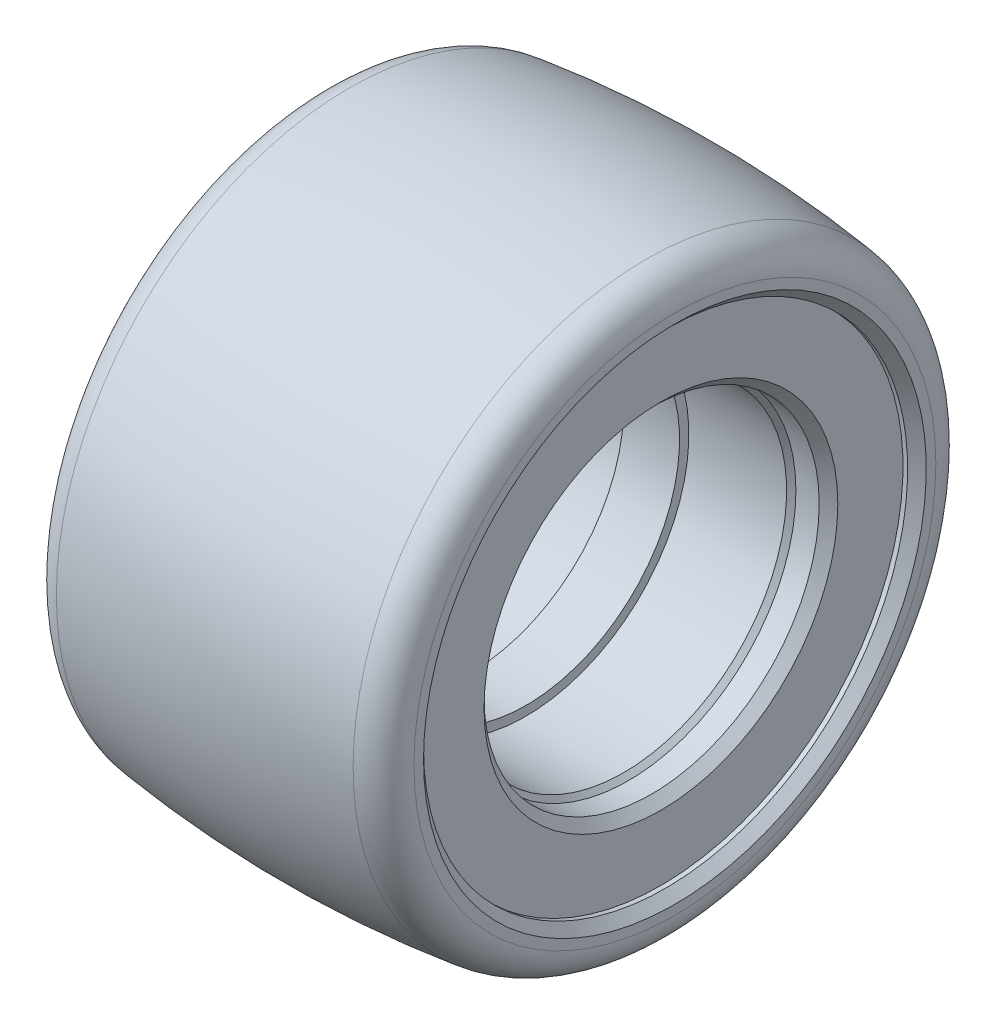
ISO-10303-21;
HEADER;
FILE_DESCRIPTION(('STEP AP214'),'2;1');
FILE_NAME('part.step','',(''),(''),'','','');
FILE_SCHEMA(('AUTOMOTIVE_DESIGN { 1 0 10303 214 1 1 1 1 }'));
ENDSEC;
DATA;
#1=APPLICATION_CONTEXT('core data for automotive mechanical design processes');
#2=APPLICATION_PROTOCOL_DEFINITION('international standard','automotive_design',2000,#1);
#3=PRODUCT_CONTEXT('',#1,'mechanical');
#4=PRODUCT('Part','Part','',(#3));
#5=PRODUCT_RELATED_PRODUCT_CATEGORY('part','',(#4));
#6=PRODUCT_DEFINITION_FORMATION('','',#4);
#7=PRODUCT_DEFINITION_CONTEXT('part definition',#1,'design');
#8=PRODUCT_DEFINITION('design','',#6,#7);
#9=PRODUCT_DEFINITION_SHAPE('','',#8);
#10=(LENGTH_UNIT() NAMED_UNIT(*) SI_UNIT(.MILLI.,.METRE.));
#11=(NAMED_UNIT(*) PLANE_ANGLE_UNIT() SI_UNIT($,.RADIAN.));
#12=(NAMED_UNIT(*) SI_UNIT($,.STERADIAN.) SOLID_ANGLE_UNIT());
#13=UNCERTAINTY_MEASURE_WITH_UNIT(LENGTH_MEASURE(1.E-05),#10,'distance_accuracy_value','');
#14=(GEOMETRIC_REPRESENTATION_CONTEXT(3) GLOBAL_UNCERTAINTY_ASSIGNED_CONTEXT((#13)) GLOBAL_UNIT_ASSIGNED_CONTEXT((#10,
#11,#12)) REPRESENTATION_CONTEXT('',''));
#15=CARTESIAN_POINT('',(0.,0.,0.));
#16=DIRECTION('',(0.,0.,1.));
#17=DIRECTION('',(1.,0.,0.));
#18=AXIS2_PLACEMENT_3D('',#15,#16,#17);
#19=CARTESIAN_POINT('',(19.,0.,0.));
#20=DIRECTION('',(-1.,0.,0.));
#21=DIRECTION('',(0.,0.,1.));
#22=AXIS2_PLACEMENT_3D('',#19,#20,#21);
#23=PLANE('',#22);
#24=CARTESIAN_POINT('',(19.,0.,0.));
#25=DIRECTION('',(-1.,0.,0.));
#26=DIRECTION('',(0.,0.,1.));
#27=AXIS2_PLACEMENT_3D('',#24,#25,#26);
#28=CIRCLE('',#27,28.0274359645035);
#29=CARTESIAN_POINT('',(19.,0.,28.0274359645035));
#30=VERTEX_POINT('',#29);
#31=EDGE_CURVE('E10',#30,#30,#28,.F.);
#32=ORIENTED_EDGE('',*,*,#31,.T.);
#33=EDGE_LOOP('',(#32));
#34=FACE_BOUND('',#33,.T.);
#35=CARTESIAN_POINT('',(19.,0.,0.));
#36=DIRECTION('',(-1.,0.,0.));
#37=DIRECTION('',(0.,0.,1.));
#38=AXIS2_PLACEMENT_3D('',#35,#36,#37);
#39=CIRCLE('',#38,27.);
#40=CARTESIAN_POINT('',(19.,0.,27.));
#41=VERTEX_POINT('',#40);
#42=EDGE_CURVE('E65',#41,#41,#39,.T.);
#43=ORIENTED_EDGE('',*,*,#42,.T.);
#44=EDGE_LOOP('',(#43));
#45=FACE_BOUND('',#44,.T.);
#46=ADVANCED_FACE('F36',(#34,#45),#23,.F.);
#47=CARTESIAN_POINT('',(-19.,0.,0.));
#48=DIRECTION('',(-1.,0.,0.));
#49=DIRECTION('',(0.,0.,1.));
#50=AXIS2_PLACEMENT_3D('',#47,#48,#49);
#51=PLANE('',#50);
#52=CARTESIAN_POINT('',(-19.,0.,0.));
#53=DIRECTION('',(-1.,0.,0.));
#54=DIRECTION('',(0.,0.,1.));
#55=AXIS2_PLACEMENT_3D('',#52,#53,#54);
#56=CIRCLE('',#55,28.0274359645035);
#57=CARTESIAN_POINT('',(-19.,0.,28.0274359645035));
#58=VERTEX_POINT('',#57);
#59=EDGE_CURVE('E51',#58,#58,#56,.T.);
#60=ORIENTED_EDGE('',*,*,#59,.T.);
#61=EDGE_LOOP('',(#60));
#62=FACE_BOUND('',#61,.T.);
#63=CARTESIAN_POINT('',(-19.,0.,0.));
#64=DIRECTION('',(-1.,0.,0.));
#65=DIRECTION('',(0.,0.,1.));
#66=AXIS2_PLACEMENT_3D('',#63,#64,#65);
#67=CIRCLE('',#66,27.);
#68=CARTESIAN_POINT('',(-19.,0.,27.));
#69=VERTEX_POINT('',#68);
#70=EDGE_CURVE('E74',#69,#69,#67,.F.);
#71=ORIENTED_EDGE('',*,*,#70,.T.);
#72=EDGE_LOOP('',(#71));
#73=FACE_BOUND('',#72,.T.);
#74=ADVANCED_FACE('F129',(#62,#73),#51,.T.);
#75=CARTESIAN_POINT('',(-17.6,0.,0.));
#76=DIRECTION('',(-1.,0.,0.));
#77=DIRECTION('',(0.,0.,1.));
#78=AXIS2_PLACEMENT_3D('',#75,#76,#77);
#79=CYLINDRICAL_SURFACE('',#78,26.);
#80=CARTESIAN_POINT('',(-18.,0.,0.));
#81=DIRECTION('',(-1.,0.,0.));
#82=DIRECTION('',(0.,0.,1.));
#83=AXIS2_PLACEMENT_3D('',#80,#81,#82);
#84=CIRCLE('',#83,26.);
#85=CARTESIAN_POINT('',(-18.,0.,26.));
#86=VERTEX_POINT('',#85);
#87=EDGE_CURVE('E77',#86,#86,#84,.T.);
#88=ORIENTED_EDGE('',*,*,#87,.T.);
#89=EDGE_LOOP('',(#88));
#90=FACE_BOUND('',#89,.T.);
#91=CARTESIAN_POINT('',(-17.5,0.,0.));
#92=DIRECTION('',(-1.,0.,0.));
#93=DIRECTION('',(0.,0.,1.));
#94=AXIS2_PLACEMENT_3D('',#91,#92,#93);
#95=CIRCLE('',#94,26.);
#96=CARTESIAN_POINT('',(-17.5,0.,26.));
#97=VERTEX_POINT('',#96);
#98=EDGE_CURVE('E86',#97,#97,#95,.T.);
#99=ORIENTED_EDGE('',*,*,#98,.F.);
#100=EDGE_LOOP('',(#99));
#101=FACE_BOUND('',#100,.T.);
#102=ADVANCED_FACE('F134',(#90,#101),#79,.F.);
#103=CARTESIAN_POINT('',(-17.5,0.,0.));
#104=DIRECTION('',(-1.,0.,0.));
#105=DIRECTION('',(0.,0.,1.));
#106=AXIS2_PLACEMENT_3D('',#103,#104,#105);
#107=PLANE('',#106);
#108=CARTESIAN_POINT('',(-17.5,0.,0.));
#109=DIRECTION('',(-1.,0.,0.));
#110=DIRECTION('',(0.,0.,1.));
#111=AXIS2_PLACEMENT_3D('',#108,#109,#110);
#112=CIRCLE('',#111,19.);
#113=CARTESIAN_POINT('',(-17.5,0.,19.));
#114=VERTEX_POINT('',#113);
#115=EDGE_CURVE('E80',#114,#114,#112,.F.);
#116=ORIENTED_EDGE('',*,*,#115,.T.);
#117=EDGE_LOOP('',(#116));
#118=FACE_BOUND('',#117,.T.);
#119=ORIENTED_EDGE('',*,*,#98,.T.);
#120=EDGE_LOOP('',(#119));
#121=FACE_BOUND('',#120,.T.);
#122=ADVANCED_FACE('F182',(#118,#121),#107,.T.);
#123=CARTESIAN_POINT('',(-17.6,0.,0.));
#124=DIRECTION('',(-1.,0.,0.));
#125=DIRECTION('',(0.,0.,1.));
#126=AXIS2_PLACEMENT_3D('',#123,#124,#125);
#127=CYLINDRICAL_SURFACE('',#126,18.);
#128=CARTESIAN_POINT('',(-16.5,0.,0.));
#129=DIRECTION('',(-1.,0.,0.));
#130=DIRECTION('',(0.,0.,1.));
#131=AXIS2_PLACEMENT_3D('',#128,#129,#130);
#132=CIRCLE('',#131,18.);
#133=CARTESIAN_POINT('',(-16.5,0.,18.));
#134=VERTEX_POINT('',#133);
#135=EDGE_CURVE('E83',#134,#134,#132,.T.);
#136=ORIENTED_EDGE('',*,*,#135,.T.);
#137=EDGE_LOOP('',(#136));
#138=FACE_BOUND('',#137,.T.);
#139=CARTESIAN_POINT('',(-14.,0.,0.));
#140=DIRECTION('',(-1.,0.,0.));
#141=DIRECTION('',(0.,0.,1.));
#142=AXIS2_PLACEMENT_3D('',#139,#140,#141);
#143=CIRCLE('',#142,18.);
#144=CARTESIAN_POINT('',(-14.,0.,18.));
#145=VERTEX_POINT('',#144);
#146=EDGE_CURVE('E89',#145,#145,#143,.T.);
#147=ORIENTED_EDGE('',*,*,#146,.F.);
#148=EDGE_LOOP('',(#147));
#149=FACE_BOUND('',#148,.T.);
#150=ADVANCED_FACE('F186',(#138,#149),#127,.F.);
#151=CARTESIAN_POINT('',(-17.6,0.,0.));
#152=DIRECTION('',(-1.,0.,0.));
#153=DIRECTION('',(0.,0.,1.));
#154=AXIS2_PLACEMENT_3D('',#151,#152,#153);
#155=CYLINDRICAL_SURFACE('',#154,17.5);
#156=CARTESIAN_POINT('',(-13.5,0.,0.));
#157=DIRECTION('',(-1.,0.,0.));
#158=DIRECTION('',(0.,0.,1.));
#159=AXIS2_PLACEMENT_3D('',#156,#157,#158);
#160=CIRCLE('',#159,17.5);
#161=CARTESIAN_POINT('',(-13.5,0.,17.5));
#162=VERTEX_POINT('',#161);
#163=EDGE_CURVE('E59',#162,#162,#160,.T.);
#164=ORIENTED_EDGE('',*,*,#163,.T.);
#165=EDGE_LOOP('',(#164));
#166=FACE_BOUND('',#165,.T.);
#167=CARTESIAN_POINT('',(-3.,0.,0.));
#168=DIRECTION('',(-1.,0.,0.));
#169=DIRECTION('',(0.,0.,1.));
#170=AXIS2_PLACEMENT_3D('',#167,#168,#169);
#171=CIRCLE('',#170,17.5);
#172=CARTESIAN_POINT('',(-3.,0.,17.5));
#173=VERTEX_POINT('',#172);
#174=EDGE_CURVE('E92',#173,#173,#171,.T.);
#175=ORIENTED_EDGE('',*,*,#174,.F.);
#176=EDGE_LOOP('',(#175));
#177=FACE_BOUND('',#176,.T.);
#178=ADVANCED_FACE('F190',(#166,#177),#155,.F.);
#179=CARTESIAN_POINT('',(-3.,0.,0.));
#180=DIRECTION('',(1.,0.,0.));
#181=DIRECTION('',(0.,0.,-1.));
#182=AXIS2_PLACEMENT_3D('',#179,#180,#181);
#183=PLANE('',#182);
#184=CARTESIAN_POINT('',(-3.,0.,0.));
#185=DIRECTION('',(-1.,0.,0.));
#186=DIRECTION('',(0.,0.,1.));
#187=AXIS2_PLACEMENT_3D('',#184,#185,#186);
#188=CIRCLE('',#187,16.5);
#189=CARTESIAN_POINT('',(-3.,0.,16.5));
#190=VERTEX_POINT('',#189);
#191=EDGE_CURVE('E95',#190,#190,#188,.T.);
#192=ORIENTED_EDGE('',*,*,#191,.F.);
#193=EDGE_LOOP('',(#192));
#194=FACE_BOUND('',#193,.T.);
#195=ORIENTED_EDGE('',*,*,#174,.T.);
#196=EDGE_LOOP('',(#195));
#197=FACE_BOUND('',#196,.T.);
#198=ADVANCED_FACE('F194',(#194,#197),#183,.F.);
#199=CARTESIAN_POINT('',(-17.6,0.,0.));
#200=DIRECTION('',(-1.,0.,0.));
#201=DIRECTION('',(0.,0.,1.));
#202=AXIS2_PLACEMENT_3D('',#199,#200,#201);
#203=CYLINDRICAL_SURFACE('',#202,16.5);
#204=CARTESIAN_POINT('',(3.,0.,0.));
#205=DIRECTION('',(-1.,0.,0.));
#206=DIRECTION('',(0.,0.,1.));
#207=AXIS2_PLACEMENT_3D('',#204,#205,#206);
#208=CIRCLE('',#207,16.5);
#209=CARTESIAN_POINT('',(3.,0.,16.5));
#210=VERTEX_POINT('',#209);
#211=EDGE_CURVE('E98',#210,#210,#208,.T.);
#212=ORIENTED_EDGE('',*,*,#211,.F.);
#213=EDGE_LOOP('',(#212));
#214=FACE_BOUND('',#213,.T.);
#215=ORIENTED_EDGE('',*,*,#191,.T.);
#216=EDGE_LOOP('',(#215));
#217=FACE_BOUND('',#216,.T.);
#218=ADVANCED_FACE('F198',(#214,#217),#203,.F.);
#219=CARTESIAN_POINT('',(3.,0.,0.));
#220=DIRECTION('',(-1.,0.,0.));
#221=DIRECTION('',(0.,0.,1.));
#222=AXIS2_PLACEMENT_3D('',#219,#220,#221);
#223=PLANE('',#222);
#224=CARTESIAN_POINT('',(3.,0.,0.));
#225=DIRECTION('',(-1.,0.,0.));
#226=DIRECTION('',(0.,0.,1.));
#227=AXIS2_PLACEMENT_3D('',#224,#225,#226);
#228=CIRCLE('',#227,17.5);
#229=CARTESIAN_POINT('',(3.,0.,17.5));
#230=VERTEX_POINT('',#229);
#231=EDGE_CURVE('E101',#230,#230,#228,.T.);
#232=ORIENTED_EDGE('',*,*,#231,.F.);
#233=EDGE_LOOP('',(#232));
#234=FACE_BOUND('',#233,.T.);
#235=ORIENTED_EDGE('',*,*,#211,.T.);
#236=EDGE_LOOP('',(#235));
#237=FACE_BOUND('',#236,.T.);
#238=ADVANCED_FACE('F202',(#234,#237),#223,.F.);
#239=CARTESIAN_POINT('',(-17.6,0.,0.));
#240=DIRECTION('',(-1.,0.,0.));
#241=DIRECTION('',(0.,0.,1.));
#242=AXIS2_PLACEMENT_3D('',#239,#240,#241);
#243=CYLINDRICAL_SURFACE('',#242,17.5);
#244=CARTESIAN_POINT('',(13.5,0.,0.));
#245=DIRECTION('',(-1.,0.,0.));
#246=DIRECTION('',(0.,0.,1.));
#247=AXIS2_PLACEMENT_3D('',#244,#245,#246);
#248=CIRCLE('',#247,17.5);
#249=CARTESIAN_POINT('',(13.5,0.,17.5));
#250=VERTEX_POINT('',#249);
#251=EDGE_CURVE('E56',#250,#250,#248,.F.);
#252=ORIENTED_EDGE('',*,*,#251,.T.);
#253=EDGE_LOOP('',(#252));
#254=FACE_BOUND('',#253,.T.);
#255=ORIENTED_EDGE('',*,*,#231,.T.);
#256=EDGE_LOOP('',(#255));
#257=FACE_BOUND('',#256,.T.);
#258=ADVANCED_FACE('F125',(#254,#257),#243,.F.);
#259=CARTESIAN_POINT('',(-17.6,0.,0.));
#260=DIRECTION('',(-1.,0.,0.));
#261=DIRECTION('',(0.,0.,1.));
#262=AXIS2_PLACEMENT_3D('',#259,#260,#261);
#263=CYLINDRICAL_SURFACE('',#262,18.);
#264=CARTESIAN_POINT('',(16.5,0.,0.));
#265=DIRECTION('',(-1.,0.,0.));
#266=DIRECTION('',(0.,0.,1.));
#267=AXIS2_PLACEMENT_3D('',#264,#265,#266);
#268=CIRCLE('',#267,18.);
#269=CARTESIAN_POINT('',(16.5,0.,18.));
#270=VERTEX_POINT('',#269);
#271=EDGE_CURVE('E68',#270,#270,#268,.F.);
#272=ORIENTED_EDGE('',*,*,#271,.T.);
#273=EDGE_LOOP('',(#272));
#274=FACE_BOUND('',#273,.T.);
#275=CARTESIAN_POINT('',(14.,0.,0.));
#276=DIRECTION('',(-1.,0.,0.));
#277=DIRECTION('',(0.,0.,1.));
#278=AXIS2_PLACEMENT_3D('',#275,#276,#277);
#279=CIRCLE('',#278,18.);
#280=CARTESIAN_POINT('',(14.,0.,18.));
#281=VERTEX_POINT('',#280);
#282=EDGE_CURVE('E104',#281,#281,#279,.T.);
#283=ORIENTED_EDGE('',*,*,#282,.T.);
#284=EDGE_LOOP('',(#283));
#285=FACE_BOUND('',#284,.T.);
#286=ADVANCED_FACE('F115',(#274,#285),#263,.F.);
#287=CARTESIAN_POINT('',(17.5,0.,0.));
#288=DIRECTION('',(-1.,0.,0.));
#289=DIRECTION('',(0.,0.,1.));
#290=AXIS2_PLACEMENT_3D('',#287,#288,#289);
#291=PLANE('',#290);
#292=CARTESIAN_POINT('',(17.5,0.,0.));
#293=DIRECTION('',(-1.,0.,0.));
#294=DIRECTION('',(0.,0.,1.));
#295=AXIS2_PLACEMENT_3D('',#292,#293,#294);
#296=CIRCLE('',#295,19.);
#297=CARTESIAN_POINT('',(17.5,0.,19.));
#298=VERTEX_POINT('',#297);
#299=EDGE_CURVE('E71',#298,#298,#296,.T.);
#300=ORIENTED_EDGE('',*,*,#299,.T.);
#301=EDGE_LOOP('',(#300));
#302=FACE_BOUND('',#301,.T.);
#303=CARTESIAN_POINT('',(17.5,0.,0.));
#304=DIRECTION('',(-1.,0.,0.));
#305=DIRECTION('',(0.,0.,1.));
#306=AXIS2_PLACEMENT_3D('',#303,#304,#305);
#307=CIRCLE('',#306,26.);
#308=CARTESIAN_POINT('',(17.5,0.,26.));
#309=VERTEX_POINT('',#308);
#310=EDGE_CURVE('E107',#309,#309,#307,.T.);
#311=ORIENTED_EDGE('',*,*,#310,.F.);
#312=EDGE_LOOP('',(#311));
#313=FACE_BOUND('',#312,.T.);
#314=ADVANCED_FACE('F113',(#302,#313),#291,.F.);
#315=CARTESIAN_POINT('',(-17.6,0.,0.));
#316=DIRECTION('',(-1.,0.,0.));
#317=DIRECTION('',(0.,0.,1.));
#318=AXIS2_PLACEMENT_3D('',#315,#316,#317);
#319=CYLINDRICAL_SURFACE('',#318,26.);
#320=CARTESIAN_POINT('',(18.,0.,0.));
#321=DIRECTION('',(-1.,0.,0.));
#322=DIRECTION('',(0.,0.,1.));
#323=AXIS2_PLACEMENT_3D('',#320,#321,#322);
#324=CIRCLE('',#323,26.);
#325=CARTESIAN_POINT('',(18.,0.,26.));
#326=VERTEX_POINT('',#325);
#327=EDGE_CURVE('E62',#326,#326,#324,.F.);
#328=ORIENTED_EDGE('',*,*,#327,.T.);
#329=EDGE_LOOP('',(#328));
#330=FACE_BOUND('',#329,.T.);
#331=ORIENTED_EDGE('',*,*,#310,.T.);
#332=EDGE_LOOP('',(#331));
#333=FACE_BOUND('',#332,.T.);
#334=ADVANCED_FACE('F111',(#330,#333),#319,.F.);
#335=CARTESIAN_POINT('',(0.,0.,0.));
#336=DIRECTION('',(-1.,0.,0.));
#337=DIRECTION('',(0.,0.,1.));
#338=AXIS2_PLACEMENT_3D('',#335,#336,#337);
#339=DEGENERATE_TOROIDAL_SURFACE('',#338,95.,127.5,.F.);
#340=CARTESIAN_POINT('',(-15.9375,0.,0.));
#341=DIRECTION('',(1.,0.,0.));
#342=DIRECTION('',(0.,0.,-1.));
#343=AXIS2_PLACEMENT_3D('',#340,#341,#342);
#344=CIRCLE('',#343,31.4999845602757);
#345=CARTESIAN_POINT('',(-15.9375,0.,-31.4999845602757));
#346=VERTEX_POINT('',#345);
#347=EDGE_CURVE('E43',#346,#346,#344,.T.);
#348=ORIENTED_EDGE('',*,*,#347,.T.);
#349=EDGE_LOOP('',(#348));
#350=FACE_BOUND('',#349,.T.);
#351=CARTESIAN_POINT('',(15.9375,0.,0.));
#352=DIRECTION('',(-1.,0.,0.));
#353=DIRECTION('',(0.,0.,1.));
#354=AXIS2_PLACEMENT_3D('',#351,#352,#353);
#355=CIRCLE('',#354,31.4999845602757);
#356=CARTESIAN_POINT('',(15.9375,0.,31.4999845602757));
#357=VERTEX_POINT('',#356);
#358=EDGE_CURVE('E47',#357,#357,#355,.T.);
#359=ORIENTED_EDGE('',*,*,#358,.T.);
#360=EDGE_LOOP('',(#359));
#361=FACE_BOUND('',#360,.T.);
#362=ADVANCED_FACE('F122',(#350,#361),#339,.F.);
#363=CARTESIAN_POINT('',(-16.5,0.,0.));
#364=DIRECTION('',(-1.,0.,0.));
#365=DIRECTION('',(0.,0.,1.));
#366=AXIS2_PLACEMENT_3D('',#363,#364,#365);
#367=CONICAL_SURFACE('',#366,18.,0.785398163397459);
#368=ORIENTED_EDGE('',*,*,#115,.F.);
#369=EDGE_LOOP('',(#368));
#370=FACE_BOUND('',#369,.T.);
#371=ORIENTED_EDGE('',*,*,#135,.F.);
#372=EDGE_LOOP('',(#371));
#373=FACE_BOUND('',#372,.T.);
#374=ADVANCED_FACE('F140',(#370,#373),#367,.F.);
#375=CARTESIAN_POINT('',(-18.,0.,0.));
#376=DIRECTION('',(-1.,0.,0.));
#377=DIRECTION('',(0.,0.,1.));
#378=AXIS2_PLACEMENT_3D('',#375,#376,#377);
#379=CONICAL_SURFACE('',#378,26.,0.78539816339745);
#380=ORIENTED_EDGE('',*,*,#70,.F.);
#381=EDGE_LOOP('',(#380));
#382=FACE_BOUND('',#381,.T.);
#383=ORIENTED_EDGE('',*,*,#87,.F.);
#384=EDGE_LOOP('',(#383));
#385=FACE_BOUND('',#384,.T.);
#386=ADVANCED_FACE('F144',(#382,#385),#379,.F.);
#387=CARTESIAN_POINT('',(17.5,0.,0.));
#388=DIRECTION('',(1.,0.,0.));
#389=DIRECTION('',(0.,0.,-1.));
#390=AXIS2_PLACEMENT_3D('',#387,#388,#389);
#391=CONICAL_SURFACE('',#390,19.,0.785398163397448);
#392=ORIENTED_EDGE('',*,*,#271,.F.);
#393=EDGE_LOOP('',(#392));
#394=FACE_BOUND('',#393,.T.);
#395=ORIENTED_EDGE('',*,*,#299,.F.);
#396=EDGE_LOOP('',(#395));
#397=FACE_BOUND('',#396,.T.);
#398=ADVANCED_FACE('F172',(#394,#397),#391,.F.);
#399=CARTESIAN_POINT('',(19.,0.,0.));
#400=DIRECTION('',(1.,0.,0.));
#401=DIRECTION('',(0.,0.,-1.));
#402=AXIS2_PLACEMENT_3D('',#399,#400,#401);
#403=CONICAL_SURFACE('',#402,27.,0.785398163397443);
#404=ORIENTED_EDGE('',*,*,#327,.F.);
#405=EDGE_LOOP('',(#404));
#406=FACE_BOUND('',#405,.T.);
#407=ORIENTED_EDGE('',*,*,#42,.F.);
#408=EDGE_LOOP('',(#407));
#409=FACE_BOUND('',#408,.T.);
#410=ADVANCED_FACE('F168',(#406,#409),#403,.F.);
#411=CARTESIAN_POINT('',(-13.5,0.,0.));
#412=DIRECTION('',(-1.,0.,0.));
#413=DIRECTION('',(0.,0.,1.));
#414=AXIS2_PLACEMENT_3D('',#411,#412,#413);
#415=CONICAL_SURFACE('',#414,17.5,0.785398163397455);
#416=ORIENTED_EDGE('',*,*,#146,.T.);
#417=EDGE_LOOP('',(#416));
#418=FACE_BOUND('',#417,.T.);
#419=ORIENTED_EDGE('',*,*,#163,.F.);
#420=EDGE_LOOP('',(#419));
#421=FACE_BOUND('',#420,.T.);
#422=ADVANCED_FACE('F161',(#418,#421),#415,.F.);
#423=CARTESIAN_POINT('',(14.,0.,0.));
#424=DIRECTION('',(1.,0.,0.));
#425=DIRECTION('',(0.,0.,-1.));
#426=AXIS2_PLACEMENT_3D('',#423,#424,#425);
#427=CONICAL_SURFACE('',#426,18.,0.785398163397441);
#428=ORIENTED_EDGE('',*,*,#251,.F.);
#429=EDGE_LOOP('',(#428));
#430=FACE_BOUND('',#429,.T.);
#431=ORIENTED_EDGE('',*,*,#282,.F.);
#432=EDGE_LOOP('',(#431));
#433=FACE_BOUND('',#432,.T.);
#434=ADVANCED_FACE('F156',(#430,#433),#427,.F.);
#435=CARTESIAN_POINT('',(-15.5,0.,0.));
#436=DIRECTION('',(-1.,0.,0.));
#437=DIRECTION('',(0.,0.,1.));
#438=AXIS2_PLACEMENT_3D('',#435,#436,#437);
#439=TOROIDAL_SURFACE('',#438,28.0274359645035,3.5);
#440=ORIENTED_EDGE('',*,*,#347,.F.);
#441=EDGE_LOOP('',(#440));
#442=FACE_BOUND('',#441,.T.);
#443=ORIENTED_EDGE('',*,*,#59,.F.);
#444=EDGE_LOOP('',(#443));
#445=FACE_BOUND('',#444,.T.);
#446=ADVANCED_FACE('F151',(#442,#445),#439,.T.);
#447=CARTESIAN_POINT('',(15.5,0.,0.));
#448=DIRECTION('',(-1.,0.,0.));
#449=DIRECTION('',(0.,0.,1.));
#450=AXIS2_PLACEMENT_3D('',#447,#448,#449);
#451=TOROIDAL_SURFACE('',#450,28.0274359645035,3.5);
#452=ORIENTED_EDGE('',*,*,#31,.F.);
#453=EDGE_LOOP('',(#452));
#454=FACE_BOUND('',#453,.T.);
#455=ORIENTED_EDGE('',*,*,#358,.F.);
#456=EDGE_LOOP('',(#455));
#457=FACE_BOUND('',#456,.T.);
#458=ADVANCED_FACE('F38',(#454,#457),#451,.T.);
#459=CLOSED_SHELL('',(#46,#74,#102,#122,#150,#178,#198,#218,#238,#258,#286,#314,#334,#362,#374,
#386,#398,#410,#422,#434,#446,#458));
#460=MANIFOLD_SOLID_BREP('B2',#459);
#461=ADVANCED_BREP_SHAPE_REPRESENTATION('',(#18,#460),#14);
#462=SHAPE_DEFINITION_REPRESENTATION(#9,#461);
ENDSEC;
END-ISO-10303-21;
